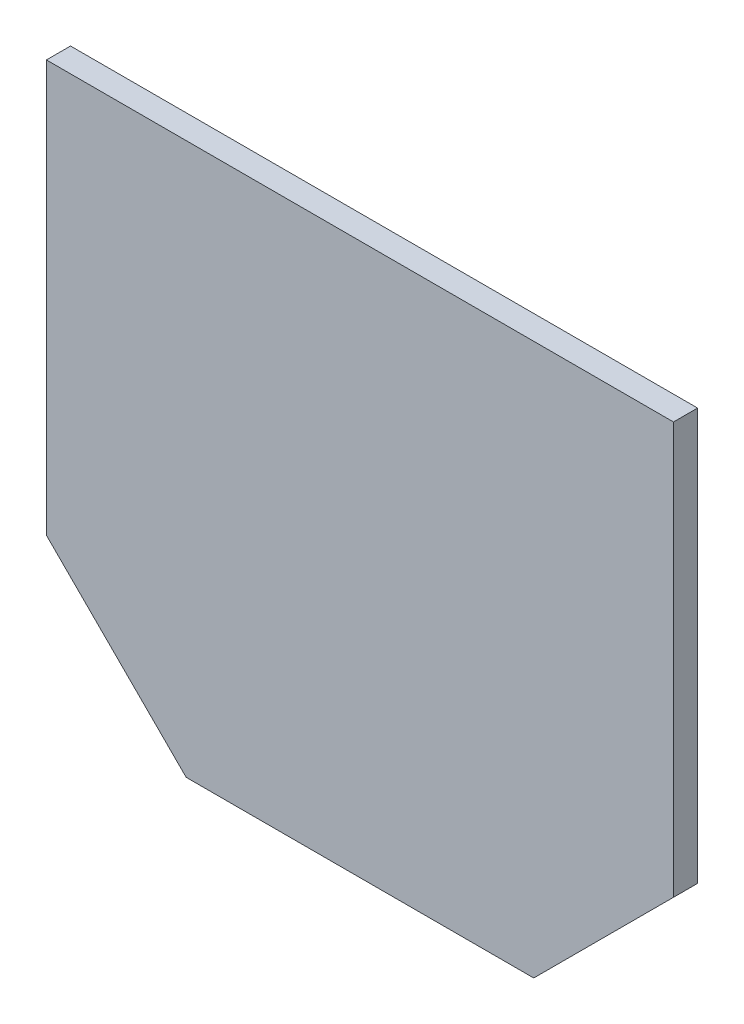
ISO-10303-21;
HEADER;
FILE_DESCRIPTION(('STEP AP214'),'2;1');
FILE_NAME('part.step','',(''),(''),'','','');
FILE_SCHEMA(('AUTOMOTIVE_DESIGN { 1 0 10303 214 1 1 1 1 }'));
ENDSEC;
DATA;
#1=APPLICATION_CONTEXT('core data for automotive mechanical design processes');
#2=APPLICATION_PROTOCOL_DEFINITION('international standard','automotive_design',2000,#1);
#3=PRODUCT_CONTEXT('',#1,'mechanical');
#4=PRODUCT('Part','Part','',(#3));
#5=PRODUCT_RELATED_PRODUCT_CATEGORY('part','',(#4));
#6=PRODUCT_DEFINITION_FORMATION('','',#4);
#7=PRODUCT_DEFINITION_CONTEXT('part definition',#1,'design');
#8=PRODUCT_DEFINITION('design','',#6,#7);
#9=PRODUCT_DEFINITION_SHAPE('','',#8);
#10=(LENGTH_UNIT() NAMED_UNIT(*) SI_UNIT(.MILLI.,.METRE.));
#11=(NAMED_UNIT(*) PLANE_ANGLE_UNIT() SI_UNIT($,.RADIAN.));
#12=(NAMED_UNIT(*) SI_UNIT($,.STERADIAN.) SOLID_ANGLE_UNIT());
#13=UNCERTAINTY_MEASURE_WITH_UNIT(LENGTH_MEASURE(1.E-05),#10,'distance_accuracy_value','');
#14=(GEOMETRIC_REPRESENTATION_CONTEXT(3) GLOBAL_UNCERTAINTY_ASSIGNED_CONTEXT((#13)) GLOBAL_UNIT_ASSIGNED_CONTEXT((#10,
#11,#12)) REPRESENTATION_CONTEXT('',''));
#15=CARTESIAN_POINT('',(0.,0.,0.));
#16=DIRECTION('',(0.,0.,1.));
#17=DIRECTION('',(1.,0.,0.));
#18=AXIS2_PLACEMENT_3D('',#15,#16,#17);
#19=CARTESIAN_POINT('',(-73.6381001927674,73.6381001927667,12.7));
#20=DIRECTION('',(0.707106781186544,0.707106781186551,0.));
#21=DIRECTION('',(-0.707106781186551,0.707106781186544,0.));
#22=AXIS2_PLACEMENT_3D('',#19,#20,#21);
#23=PLANE('',#22);
#24=DIRECTION('',(0.707106781186551,-0.707106781186544,0.));
#25=VECTOR('',#24,1.);
#26=CARTESIAN_POINT('',(-73.6381001927674,73.6381001927667,0.));
#27=LINE('',#26,#25);
#28=CARTESIAN_POINT('',(-73.6381001927674,73.6381001927667,0.));
#29=VERTEX_POINT('',#28);
#30=CARTESIAN_POINT('',(0.,0.,0.));
#31=VERTEX_POINT('',#30);
#32=EDGE_CURVE('E119',#29,#31,#27,.T.);
#33=ORIENTED_EDGE('',*,*,#32,.T.);
#34=DIRECTION('',(0.,0.,-1.));
#35=VECTOR('',#34,1.);
#36=CARTESIAN_POINT('',(0.,0.,12.7));
#37=LINE('',#36,#35);
#38=CARTESIAN_POINT('',(0.,0.,12.7));
#39=VERTEX_POINT('',#38);
#40=EDGE_CURVE('E11',#39,#31,#37,.T.);
#41=ORIENTED_EDGE('',*,*,#40,.F.);
#42=DIRECTION('',(0.707106781186551,-0.707106781186544,0.));
#43=VECTOR('',#42,1.);
#44=CARTESIAN_POINT('',(-73.6381001927674,73.6381001927667,12.7));
#45=LINE('',#44,#43);
#46=CARTESIAN_POINT('',(-73.6381001927674,73.6381001927667,12.7));
#47=VERTEX_POINT('',#46);
#48=EDGE_CURVE('E129',#47,#39,#45,.T.);
#49=ORIENTED_EDGE('',*,*,#48,.F.);
#50=DIRECTION('',(0.,0.,-1.));
#51=VECTOR('',#50,1.);
#52=CARTESIAN_POINT('',(-73.6381001927674,73.6381001927667,12.7));
#53=LINE('',#52,#51);
#54=EDGE_CURVE('E115',#47,#29,#53,.T.);
#55=ORIENTED_EDGE('',*,*,#54,.T.);
#56=EDGE_LOOP('',(#33,#41,#49,#55));
#57=FACE_BOUND('',#56,.T.);
#58=ADVANCED_FACE('F35',(#57),#23,.F.);
#59=CARTESIAN_POINT('',(0.,0.,12.7));
#60=DIRECTION('',(0.,1.,0.));
#61=DIRECTION('',(0.,0.,1.));
#62=AXIS2_PLACEMENT_3D('',#59,#60,#61);
#63=PLANE('',#62);
#64=DIRECTION('',(1.,0.,0.));
#65=VECTOR('',#64,1.);
#66=CARTESIAN_POINT('',(0.,0.,0.));
#67=LINE('',#66,#65);
#68=CARTESIAN_POINT('',(183.134,0.,0.));
#69=VERTEX_POINT('',#68);
#70=EDGE_CURVE('E122',#31,#69,#67,.T.);
#71=ORIENTED_EDGE('',*,*,#70,.T.);
#72=DIRECTION('',(0.,0.,-1.));
#73=VECTOR('',#72,1.);
#74=CARTESIAN_POINT('',(183.134,0.,12.7));
#75=LINE('',#74,#73);
#76=CARTESIAN_POINT('',(183.134,0.,12.7));
#77=VERTEX_POINT('',#76);
#78=EDGE_CURVE('E43',#77,#69,#75,.T.);
#79=ORIENTED_EDGE('',*,*,#78,.F.);
#80=DIRECTION('',(1.,0.,0.));
#81=VECTOR('',#80,1.);
#82=CARTESIAN_POINT('',(0.,0.,12.7));
#83=LINE('',#82,#81);
#84=EDGE_CURVE('E88',#39,#77,#83,.T.);
#85=ORIENTED_EDGE('',*,*,#84,.F.);
#86=ORIENTED_EDGE('',*,*,#40,.T.);
#87=EDGE_LOOP('',(#71,#79,#85,#86));
#88=FACE_BOUND('',#87,.T.);
#89=ADVANCED_FACE('F153',(#88),#63,.F.);
#90=CARTESIAN_POINT('',(183.134,0.,12.7));
#91=DIRECTION('',(-0.707106781186545,0.70710678118655,0.));
#92=DIRECTION('',(-0.70710678118655,-0.707106781186545,0.));
#93=AXIS2_PLACEMENT_3D('',#90,#91,#92);
#94=PLANE('',#93);
#95=DIRECTION('',(0.70710678118655,0.707106781186545,0.));
#96=VECTOR('',#95,1.);
#97=CARTESIAN_POINT('',(183.134,0.,0.));
#98=LINE('',#97,#96);
#99=CARTESIAN_POINT('',(256.772100192767,73.6381001927668,0.));
#100=VERTEX_POINT('',#99);
#101=EDGE_CURVE('E124',#69,#100,#98,.T.);
#102=ORIENTED_EDGE('',*,*,#101,.T.);
#103=DIRECTION('',(0.,0.,-1.));
#104=VECTOR('',#103,1.);
#105=CARTESIAN_POINT('',(256.772100192767,73.6381001927668,12.7));
#106=LINE('',#105,#104);
#107=CARTESIAN_POINT('',(256.772100192767,73.6381001927668,12.7));
#108=VERTEX_POINT('',#107);
#109=EDGE_CURVE('E110',#108,#100,#106,.T.);
#110=ORIENTED_EDGE('',*,*,#109,.F.);
#111=DIRECTION('',(0.70710678118655,0.707106781186545,0.));
#112=VECTOR('',#111,1.);
#113=CARTESIAN_POINT('',(183.134,0.,12.7));
#114=LINE('',#113,#112);
#115=EDGE_CURVE('E101',#77,#108,#114,.T.);
#116=ORIENTED_EDGE('',*,*,#115,.F.);
#117=ORIENTED_EDGE('',*,*,#78,.T.);
#118=EDGE_LOOP('',(#102,#110,#116,#117));
#119=FACE_BOUND('',#118,.T.);
#120=ADVANCED_FACE('F135',(#119),#94,.F.);
#121=CARTESIAN_POINT('',(256.772100192767,73.6381001927668,12.7));
#122=DIRECTION('',(-1.,0.,0.));
#123=DIRECTION('',(0.,0.,1.));
#124=AXIS2_PLACEMENT_3D('',#121,#122,#123);
#125=PLANE('',#124);
#126=DIRECTION('',(0.,1.,0.));
#127=VECTOR('',#126,1.);
#128=CARTESIAN_POINT('',(256.772100192767,73.6381001927668,0.));
#129=LINE('',#128,#127);
#130=CARTESIAN_POINT('',(256.772100192767,290.554100192767,0.));
#131=VERTEX_POINT('',#130);
#132=EDGE_CURVE('E109',#100,#131,#129,.T.);
#133=ORIENTED_EDGE('',*,*,#132,.T.);
#134=DIRECTION('',(0.,0.,-1.));
#135=VECTOR('',#134,1.);
#136=CARTESIAN_POINT('',(256.772100192767,290.554100192767,12.7));
#137=LINE('',#136,#135);
#138=CARTESIAN_POINT('',(256.772100192767,290.554100192767,12.7));
#139=VERTEX_POINT('',#138);
#140=EDGE_CURVE('E106',#139,#131,#137,.T.);
#141=ORIENTED_EDGE('',*,*,#140,.F.);
#142=DIRECTION('',(0.,1.,0.));
#143=VECTOR('',#142,1.);
#144=CARTESIAN_POINT('',(256.772100192767,73.6381001927668,12.7));
#145=LINE('',#144,#143);
#146=EDGE_CURVE('E95',#108,#139,#145,.T.);
#147=ORIENTED_EDGE('',*,*,#146,.F.);
#148=ORIENTED_EDGE('',*,*,#109,.T.);
#149=EDGE_LOOP('',(#133,#141,#147,#148));
#150=FACE_BOUND('',#149,.T.);
#151=ADVANCED_FACE('F107',(#150),#125,.F.);
#152=CARTESIAN_POINT('',(256.772100192767,290.554100192767,12.7));
#153=DIRECTION('',(0.,-1.,0.));
#154=DIRECTION('',(1.,0.,0.));
#155=AXIS2_PLACEMENT_3D('',#152,#153,#154);
#156=PLANE('',#155);
#157=DIRECTION('',(-1.,0.,0.));
#158=VECTOR('',#157,1.);
#159=CARTESIAN_POINT('',(256.772100192767,290.554100192767,0.));
#160=LINE('',#159,#158);
#161=CARTESIAN_POINT('',(-73.6381001927674,290.554100192767,0.));
#162=VERTEX_POINT('',#161);
#163=EDGE_CURVE('E74',#131,#162,#160,.T.);
#164=ORIENTED_EDGE('',*,*,#163,.T.);
#165=DIRECTION('',(0.,0.,-1.));
#166=VECTOR('',#165,1.);
#167=CARTESIAN_POINT('',(-73.6381001927674,290.554100192767,12.7));
#168=LINE('',#167,#166);
#169=CARTESIAN_POINT('',(-73.6381001927674,290.554100192767,12.7));
#170=VERTEX_POINT('',#169);
#171=EDGE_CURVE('E111',#170,#162,#168,.T.);
#172=ORIENTED_EDGE('',*,*,#171,.F.);
#173=DIRECTION('',(-1.,0.,0.));
#174=VECTOR('',#173,1.);
#175=CARTESIAN_POINT('',(256.772100192767,290.554100192767,12.7));
#176=LINE('',#175,#174);
#177=EDGE_CURVE('E99',#139,#170,#176,.T.);
#178=ORIENTED_EDGE('',*,*,#177,.F.);
#179=ORIENTED_EDGE('',*,*,#140,.T.);
#180=EDGE_LOOP('',(#164,#172,#178,#179));
#181=FACE_BOUND('',#180,.T.);
#182=ADVANCED_FACE('F113',(#181),#156,.F.);
#183=CARTESIAN_POINT('',(-73.6381001927674,290.554100192767,12.7));
#184=DIRECTION('',(1.,0.,0.));
#185=DIRECTION('',(0.,1.,0.));
#186=AXIS2_PLACEMENT_3D('',#183,#184,#185);
#187=PLANE('',#186);
#188=DIRECTION('',(0.,-1.,0.));
#189=VECTOR('',#188,1.);
#190=CARTESIAN_POINT('',(-73.6381001927674,290.554100192767,0.));
#191=LINE('',#190,#189);
#192=EDGE_CURVE('E80',#162,#29,#191,.T.);
#193=ORIENTED_EDGE('',*,*,#192,.T.);
#194=ORIENTED_EDGE('',*,*,#54,.F.);
#195=DIRECTION('',(0.,-1.,0.));
#196=VECTOR('',#195,1.);
#197=CARTESIAN_POINT('',(-73.6381001927674,290.554100192767,12.7));
#198=LINE('',#197,#196);
#199=EDGE_CURVE('E51',#170,#47,#198,.T.);
#200=ORIENTED_EDGE('',*,*,#199,.F.);
#201=ORIENTED_EDGE('',*,*,#171,.T.);
#202=EDGE_LOOP('',(#193,#194,#200,#201));
#203=FACE_BOUND('',#202,.T.);
#204=ADVANCED_FACE('F142',(#203),#187,.F.);
#205=CARTESIAN_POINT('',(0.,0.,12.7));
#206=DIRECTION('',(0.,0.,1.));
#207=DIRECTION('',(1.,0.,0.));
#208=AXIS2_PLACEMENT_3D('',#205,#206,#207);
#209=PLANE('',#208);
#210=ORIENTED_EDGE('',*,*,#48,.T.);
#211=ORIENTED_EDGE('',*,*,#84,.T.);
#212=ORIENTED_EDGE('',*,*,#115,.T.);
#213=ORIENTED_EDGE('',*,*,#146,.T.);
#214=ORIENTED_EDGE('',*,*,#177,.T.);
#215=ORIENTED_EDGE('',*,*,#199,.T.);
#216=EDGE_LOOP('',(#210,#211,#212,#213,#214,#215));
#217=FACE_BOUND('',#216,.T.);
#218=ADVANCED_FACE('F97',(#217),#209,.T.);
#219=CARTESIAN_POINT('',(0.,0.,0.));
#220=DIRECTION('',(0.,0.,1.));
#221=DIRECTION('',(1.,0.,0.));
#222=AXIS2_PLACEMENT_3D('',#219,#220,#221);
#223=PLANE('',#222);
#224=ORIENTED_EDGE('',*,*,#32,.F.);
#225=ORIENTED_EDGE('',*,*,#192,.F.);
#226=ORIENTED_EDGE('',*,*,#163,.F.);
#227=ORIENTED_EDGE('',*,*,#132,.F.);
#228=ORIENTED_EDGE('',*,*,#101,.F.);
#229=ORIENTED_EDGE('',*,*,#70,.F.);
#230=EDGE_LOOP('',(#224,#225,#226,#227,#228,#229));
#231=FACE_BOUND('',#230,.T.);
#232=ADVANCED_FACE('F138',(#231),#223,.F.);
#233=CLOSED_SHELL('',(#58,#89,#120,#151,#182,#204,#218,#232));
#234=MANIFOLD_SOLID_BREP('B2',#233);
#235=ADVANCED_BREP_SHAPE_REPRESENTATION('',(#18,#234),#14);
#236=SHAPE_DEFINITION_REPRESENTATION(#9,#235);
ENDSEC;
END-ISO-10303-21;
